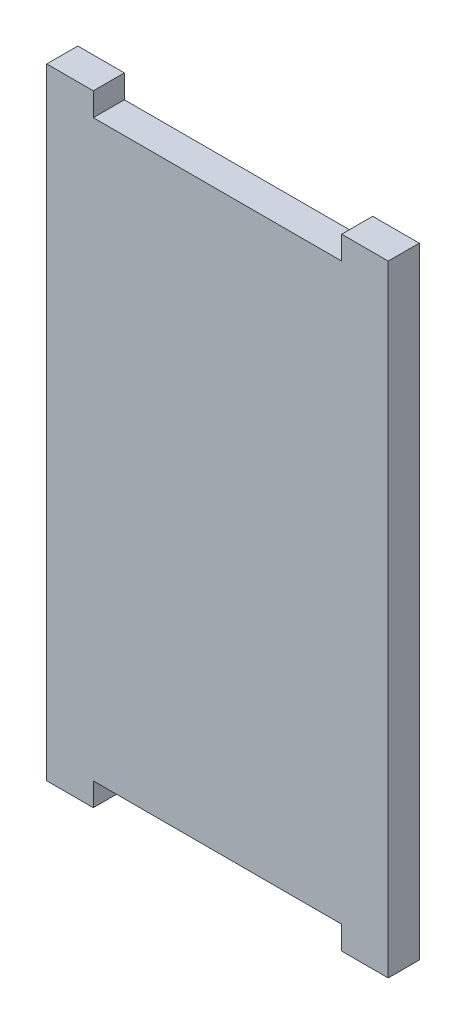
ISO-10303-21;
HEADER;
FILE_DESCRIPTION(('STEP AP214'),'2;1');
FILE_NAME('part.step','',(''),(''),'','','');
FILE_SCHEMA(('AUTOMOTIVE_DESIGN { 1 0 10303 214 1 1 1 1 }'));
ENDSEC;
DATA;
#1=APPLICATION_CONTEXT('core data for automotive mechanical design processes');
#2=APPLICATION_PROTOCOL_DEFINITION('international standard','automotive_design',2000,#1);
#3=PRODUCT_CONTEXT('',#1,'mechanical');
#4=PRODUCT('Part','Part','',(#3));
#5=PRODUCT_RELATED_PRODUCT_CATEGORY('part','',(#4));
#6=PRODUCT_DEFINITION_FORMATION('','',#4);
#7=PRODUCT_DEFINITION_CONTEXT('part definition',#1,'design');
#8=PRODUCT_DEFINITION('design','',#6,#7);
#9=PRODUCT_DEFINITION_SHAPE('','',#8);
#10=(LENGTH_UNIT() NAMED_UNIT(*) SI_UNIT(.MILLI.,.METRE.));
#11=(NAMED_UNIT(*) PLANE_ANGLE_UNIT() SI_UNIT($,.RADIAN.));
#12=(NAMED_UNIT(*) SI_UNIT($,.STERADIAN.) SOLID_ANGLE_UNIT());
#13=UNCERTAINTY_MEASURE_WITH_UNIT(LENGTH_MEASURE(1.E-05),#10,'distance_accuracy_value','');
#14=(GEOMETRIC_REPRESENTATION_CONTEXT(3) GLOBAL_UNCERTAINTY_ASSIGNED_CONTEXT((#13)) GLOBAL_UNIT_ASSIGNED_CONTEXT((#10,
#11,#12)) REPRESENTATION_CONTEXT('',''));
#15=CARTESIAN_POINT('',(0.,0.,0.));
#16=DIRECTION('',(0.,0.,1.));
#17=DIRECTION('',(1.,0.,0.));
#18=AXIS2_PLACEMENT_3D('',#15,#16,#17);
#19=CARTESIAN_POINT('',(0.,0.,4.));
#20=DIRECTION('',(0.,1.,0.));
#21=DIRECTION('',(0.,0.,1.));
#22=AXIS2_PLACEMENT_3D('',#19,#20,#21);
#23=PLANE('',#22);
#24=DIRECTION('',(1.,0.,0.));
#25=VECTOR('',#24,1.);
#26=CARTESIAN_POINT('',(0.,0.,0.));
#27=LINE('',#26,#25);
#28=CARTESIAN_POINT('',(0.,0.,0.));
#29=VERTEX_POINT('',#28);
#30=CARTESIAN_POINT('',(6.,0.,0.));
#31=VERTEX_POINT('',#30);
#32=EDGE_CURVE('E198',#29,#31,#27,.T.);
#33=ORIENTED_EDGE('',*,*,#32,.T.);
#34=DIRECTION('',(0.,0.,1.));
#35=VECTOR('',#34,1.);
#36=CARTESIAN_POINT('',(6.,0.,0.));
#37=LINE('',#36,#35);
#38=CARTESIAN_POINT('',(6.,0.,4.));
#39=VERTEX_POINT('',#38);
#40=EDGE_CURVE('E149',#31,#39,#37,.T.);
#41=ORIENTED_EDGE('',*,*,#40,.T.);
#42=DIRECTION('',(1.,0.,0.));
#43=VECTOR('',#42,1.);
#44=CARTESIAN_POINT('',(0.,0.,4.));
#45=LINE('',#44,#43);
#46=CARTESIAN_POINT('',(0.,0.,4.));
#47=VERTEX_POINT('',#46);
#48=EDGE_CURVE('E185',#47,#39,#45,.T.);
#49=ORIENTED_EDGE('',*,*,#48,.F.);
#50=DIRECTION('',(0.,0.,-1.));
#51=VECTOR('',#50,1.);
#52=CARTESIAN_POINT('',(0.,0.,4.));
#53=LINE('',#52,#51);
#54=EDGE_CURVE('E11',#47,#29,#53,.T.);
#55=ORIENTED_EDGE('',*,*,#54,.T.);
#56=EDGE_LOOP('',(#33,#41,#49,#55));
#57=FACE_BOUND('',#56,.T.);
#58=ADVANCED_FACE('F33',(#57),#23,.F.);
#59=CARTESIAN_POINT('',(0.,80.,4.));
#60=DIRECTION('',(0.,-1.,0.));
#61=DIRECTION('',(0.,0.,-1.));
#62=AXIS2_PLACEMENT_3D('',#59,#60,#61);
#63=PLANE('',#62);
#64=DIRECTION('',(-1.,0.,0.));
#65=VECTOR('',#64,1.);
#66=CARTESIAN_POINT('',(0.,80.,4.));
#67=LINE('',#66,#65);
#68=CARTESIAN_POINT('',(5.99999999999999,80.,4.));
#69=VERTEX_POINT('',#68);
#70=CARTESIAN_POINT('',(0.,80.,4.));
#71=VERTEX_POINT('',#70);
#72=EDGE_CURVE('E190',#69,#71,#67,.T.);
#73=ORIENTED_EDGE('',*,*,#72,.F.);
#74=DIRECTION('',(0.,0.,1.));
#75=VECTOR('',#74,1.);
#76=CARTESIAN_POINT('',(5.99999999999999,80.,0.));
#77=LINE('',#76,#75);
#78=CARTESIAN_POINT('',(5.99999999999999,80.,0.));
#79=VERTEX_POINT('',#78);
#80=EDGE_CURVE('E154',#79,#69,#77,.T.);
#81=ORIENTED_EDGE('',*,*,#80,.F.);
#82=DIRECTION('',(-1.,0.,0.));
#83=VECTOR('',#82,1.);
#84=CARTESIAN_POINT('',(0.,80.,0.));
#85=LINE('',#84,#83);
#86=CARTESIAN_POINT('',(0.,80.,0.));
#87=VERTEX_POINT('',#86);
#88=EDGE_CURVE('E203',#79,#87,#85,.T.);
#89=ORIENTED_EDGE('',*,*,#88,.T.);
#90=DIRECTION('',(0.,0.,-1.));
#91=VECTOR('',#90,1.);
#92=CARTESIAN_POINT('',(0.,80.,4.));
#93=LINE('',#92,#91);
#94=EDGE_CURVE('E194',#71,#87,#93,.T.);
#95=ORIENTED_EDGE('',*,*,#94,.F.);
#96=EDGE_LOOP('',(#73,#81,#89,#95));
#97=FACE_BOUND('',#96,.T.);
#98=ADVANCED_FACE('F241',(#97),#63,.F.);
#99=CARTESIAN_POINT('',(0.,0.,4.));
#100=DIRECTION('',(1.,0.,0.));
#101=DIRECTION('',(0.,0.,-1.));
#102=AXIS2_PLACEMENT_3D('',#99,#100,#101);
#103=PLANE('',#102);
#104=DIRECTION('',(0.,-1.,0.));
#105=VECTOR('',#104,1.);
#106=CARTESIAN_POINT('',(0.,0.,0.));
#107=LINE('',#106,#105);
#108=EDGE_CURVE('E153',#87,#29,#107,.T.);
#109=ORIENTED_EDGE('',*,*,#108,.T.);
#110=ORIENTED_EDGE('',*,*,#54,.F.);
#111=DIRECTION('',(0.,-1.,0.));
#112=VECTOR('',#111,1.);
#113=CARTESIAN_POINT('',(0.,0.,4.));
#114=LINE('',#113,#112);
#115=EDGE_CURVE('E180',#71,#47,#114,.T.);
#116=ORIENTED_EDGE('',*,*,#115,.F.);
#117=ORIENTED_EDGE('',*,*,#94,.T.);
#118=EDGE_LOOP('',(#109,#110,#116,#117));
#119=FACE_BOUND('',#118,.T.);
#120=ADVANCED_FACE('F35',(#119),#103,.F.);
#121=CARTESIAN_POINT('',(38.,0.,4.));
#122=VERTEX_POINT('',#121);
#123=CARTESIAN_POINT('',(44.,0.,4.));
#124=VERTEX_POINT('',#123);
#125=EDGE_CURVE('E183',#122,#124,#45,.T.);
#126=ORIENTED_EDGE('',*,*,#125,.F.);
#127=DIRECTION('',(0.,0.,1.));
#128=VECTOR('',#127,1.);
#129=CARTESIAN_POINT('',(38.,0.,0.));
#130=LINE('',#129,#128);
#131=CARTESIAN_POINT('',(38.,0.,0.));
#132=VERTEX_POINT('',#131);
#133=EDGE_CURVE('E165',#132,#122,#130,.T.);
#134=ORIENTED_EDGE('',*,*,#133,.F.);
#135=CARTESIAN_POINT('',(44.,0.,0.));
#136=VERTEX_POINT('',#135);
#137=EDGE_CURVE('E197',#132,#136,#27,.T.);
#138=ORIENTED_EDGE('',*,*,#137,.T.);
#139=DIRECTION('',(0.,0.,-1.));
#140=VECTOR('',#139,1.);
#141=CARTESIAN_POINT('',(44.,0.,4.));
#142=LINE('',#141,#140);
#143=EDGE_CURVE('E41',#124,#136,#142,.T.);
#144=ORIENTED_EDGE('',*,*,#143,.F.);
#145=EDGE_LOOP('',(#126,#134,#138,#144));
#146=FACE_BOUND('',#145,.T.);
#147=ADVANCED_FACE('F227',(#146),#23,.F.);
#148=CARTESIAN_POINT('',(44.,0.,4.));
#149=DIRECTION('',(-1.,0.,0.));
#150=DIRECTION('',(0.,0.,1.));
#151=AXIS2_PLACEMENT_3D('',#148,#149,#150);
#152=PLANE('',#151);
#153=DIRECTION('',(0.,1.,0.));
#154=VECTOR('',#153,1.);
#155=CARTESIAN_POINT('',(44.,0.,0.));
#156=LINE('',#155,#154);
#157=CARTESIAN_POINT('',(44.,80.,0.));
#158=VERTEX_POINT('',#157);
#159=EDGE_CURVE('E201',#136,#158,#156,.T.);
#160=ORIENTED_EDGE('',*,*,#159,.T.);
#161=DIRECTION('',(0.,0.,-1.));
#162=VECTOR('',#161,1.);
#163=CARTESIAN_POINT('',(44.,80.,4.));
#164=LINE('',#163,#162);
#165=CARTESIAN_POINT('',(44.,80.,4.));
#166=VERTEX_POINT('',#165);
#167=EDGE_CURVE('E207',#166,#158,#164,.T.);
#168=ORIENTED_EDGE('',*,*,#167,.F.);
#169=DIRECTION('',(0.,1.,0.));
#170=VECTOR('',#169,1.);
#171=CARTESIAN_POINT('',(44.,0.,4.));
#172=LINE('',#171,#170);
#173=EDGE_CURVE('E188',#124,#166,#172,.T.);
#174=ORIENTED_EDGE('',*,*,#173,.F.);
#175=ORIENTED_EDGE('',*,*,#143,.T.);
#176=EDGE_LOOP('',(#160,#168,#174,#175));
#177=FACE_BOUND('',#176,.T.);
#178=ADVANCED_FACE('F214',(#177),#152,.F.);
#179=CARTESIAN_POINT('',(38.,80.,0.));
#180=VERTEX_POINT('',#179);
#181=EDGE_CURVE('E184',#158,#180,#85,.T.);
#182=ORIENTED_EDGE('',*,*,#181,.T.);
#183=DIRECTION('',(0.,0.,1.));
#184=VECTOR('',#183,1.);
#185=CARTESIAN_POINT('',(38.,80.,0.));
#186=LINE('',#185,#184);
#187=CARTESIAN_POINT('',(38.,80.,4.));
#188=VERTEX_POINT('',#187);
#189=EDGE_CURVE('E56',#180,#188,#186,.T.);
#190=ORIENTED_EDGE('',*,*,#189,.T.);
#191=EDGE_CURVE('E191',#166,#188,#67,.T.);
#192=ORIENTED_EDGE('',*,*,#191,.F.);
#193=ORIENTED_EDGE('',*,*,#167,.T.);
#194=EDGE_LOOP('',(#182,#190,#192,#193));
#195=FACE_BOUND('',#194,.T.);
#196=ADVANCED_FACE('F220',(#195),#63,.F.);
#197=CARTESIAN_POINT('',(0.,0.,4.));
#198=DIRECTION('',(0.,0.,-1.));
#199=DIRECTION('',(-1.,0.,0.));
#200=AXIS2_PLACEMENT_3D('',#197,#198,#199);
#201=PLANE('',#200);
#202=DIRECTION('',(1.,0.,0.));
#203=VECTOR('',#202,1.);
#204=CARTESIAN_POINT('',(5.99999999999999,77.,4.));
#205=LINE('',#204,#203);
#206=CARTESIAN_POINT('',(5.99999999999999,77.,4.));
#207=VERTEX_POINT('',#206);
#208=CARTESIAN_POINT('',(38.,77.,4.));
#209=VERTEX_POINT('',#208);
#210=EDGE_CURVE('E129',#207,#209,#205,.T.);
#211=ORIENTED_EDGE('',*,*,#210,.F.);
#212=DIRECTION('',(0.,-1.,0.));
#213=VECTOR('',#212,1.);
#214=CARTESIAN_POINT('',(5.99999999999999,80.,4.));
#215=LINE('',#214,#213);
#216=EDGE_CURVE('E141',#69,#207,#215,.T.);
#217=ORIENTED_EDGE('',*,*,#216,.F.);
#218=ORIENTED_EDGE('',*,*,#72,.T.);
#219=ORIENTED_EDGE('',*,*,#115,.T.);
#220=ORIENTED_EDGE('',*,*,#48,.T.);
#221=DIRECTION('',(0.,-1.,0.));
#222=VECTOR('',#221,1.);
#223=CARTESIAN_POINT('',(6.,0.,4.));
#224=LINE('',#223,#222);
#225=CARTESIAN_POINT('',(6.,3.,4.));
#226=VERTEX_POINT('',#225);
#227=EDGE_CURVE('E160',#226,#39,#224,.T.);
#228=ORIENTED_EDGE('',*,*,#227,.F.);
#229=DIRECTION('',(-1.,0.,0.));
#230=VECTOR('',#229,1.);
#231=CARTESIAN_POINT('',(6.,3.,4.));
#232=LINE('',#231,#230);
#233=CARTESIAN_POINT('',(38.,3.,4.));
#234=VERTEX_POINT('',#233);
#235=EDGE_CURVE('E169',#234,#226,#232,.T.);
#236=ORIENTED_EDGE('',*,*,#235,.F.);
#237=DIRECTION('',(0.,1.,0.));
#238=VECTOR('',#237,1.);
#239=CARTESIAN_POINT('',(38.,3.,4.));
#240=LINE('',#239,#238);
#241=EDGE_CURVE('E166',#122,#234,#240,.T.);
#242=ORIENTED_EDGE('',*,*,#241,.F.);
#243=ORIENTED_EDGE('',*,*,#125,.T.);
#244=ORIENTED_EDGE('',*,*,#173,.T.);
#245=ORIENTED_EDGE('',*,*,#191,.T.);
#246=DIRECTION('',(0.,1.,0.));
#247=VECTOR('',#246,1.);
#248=CARTESIAN_POINT('',(38.,77.,4.));
#249=LINE('',#248,#247);
#250=EDGE_CURVE('E144',#209,#188,#249,.T.);
#251=ORIENTED_EDGE('',*,*,#250,.F.);
#252=EDGE_LOOP('',(#211,#217,#218,#219,#220,#228,#236,#242,#243,#244,#245,#251));
#253=FACE_BOUND('',#252,.T.);
#254=ADVANCED_FACE('F223',(#253),#201,.F.);
#255=CARTESIAN_POINT('',(0.,0.,0.));
#256=DIRECTION('',(0.,0.,-1.));
#257=DIRECTION('',(-1.,0.,0.));
#258=AXIS2_PLACEMENT_3D('',#255,#256,#257);
#259=PLANE('',#258);
#260=DIRECTION('',(0.,-1.,0.));
#261=VECTOR('',#260,1.);
#262=CARTESIAN_POINT('',(5.99999999999999,80.,0.));
#263=LINE('',#262,#261);
#264=CARTESIAN_POINT('',(5.99999999999999,77.,0.));
#265=VERTEX_POINT('',#264);
#266=EDGE_CURVE('E131',#79,#265,#263,.T.);
#267=ORIENTED_EDGE('',*,*,#266,.T.);
#268=DIRECTION('',(1.,0.,0.));
#269=VECTOR('',#268,1.);
#270=CARTESIAN_POINT('',(5.99999999999999,77.,0.));
#271=LINE('',#270,#269);
#272=CARTESIAN_POINT('',(38.,77.,0.));
#273=VERTEX_POINT('',#272);
#274=EDGE_CURVE('E126',#265,#273,#271,.T.);
#275=ORIENTED_EDGE('',*,*,#274,.T.);
#276=DIRECTION('',(0.,1.,0.));
#277=VECTOR('',#276,1.);
#278=CARTESIAN_POINT('',(38.,77.,0.));
#279=LINE('',#278,#277);
#280=EDGE_CURVE('E133',#273,#180,#279,.T.);
#281=ORIENTED_EDGE('',*,*,#280,.T.);
#282=ORIENTED_EDGE('',*,*,#181,.F.);
#283=ORIENTED_EDGE('',*,*,#159,.F.);
#284=ORIENTED_EDGE('',*,*,#137,.F.);
#285=DIRECTION('',(0.,1.,0.));
#286=VECTOR('',#285,1.);
#287=CARTESIAN_POINT('',(38.,3.,0.));
#288=LINE('',#287,#286);
#289=CARTESIAN_POINT('',(38.,3.,0.));
#290=VERTEX_POINT('',#289);
#291=EDGE_CURVE('E157',#132,#290,#288,.T.);
#292=ORIENTED_EDGE('',*,*,#291,.T.);
#293=DIRECTION('',(-1.,0.,0.));
#294=VECTOR('',#293,1.);
#295=CARTESIAN_POINT('',(6.,3.,0.));
#296=LINE('',#295,#294);
#297=CARTESIAN_POINT('',(6.,3.,0.));
#298=VERTEX_POINT('',#297);
#299=EDGE_CURVE('E48',#290,#298,#296,.T.);
#300=ORIENTED_EDGE('',*,*,#299,.T.);
#301=DIRECTION('',(0.,-1.,0.));
#302=VECTOR('',#301,1.);
#303=CARTESIAN_POINT('',(6.,0.,0.));
#304=LINE('',#303,#302);
#305=EDGE_CURVE('E162',#298,#31,#304,.T.);
#306=ORIENTED_EDGE('',*,*,#305,.T.);
#307=ORIENTED_EDGE('',*,*,#32,.F.);
#308=ORIENTED_EDGE('',*,*,#108,.F.);
#309=ORIENTED_EDGE('',*,*,#88,.F.);
#310=EDGE_LOOP('',(#267,#275,#281,#282,#283,#284,#292,#300,#306,#307,#308,#309));
#311=FACE_BOUND('',#310,.T.);
#312=ADVANCED_FACE('F139',(#311),#259,.T.);
#313=CARTESIAN_POINT('',(6.,0.,0.));
#314=DIRECTION('',(-1.,0.,0.));
#315=DIRECTION('',(0.,0.,1.));
#316=AXIS2_PLACEMENT_3D('',#313,#314,#315);
#317=PLANE('',#316);
#318=ORIENTED_EDGE('',*,*,#227,.T.);
#319=ORIENTED_EDGE('',*,*,#40,.F.);
#320=ORIENTED_EDGE('',*,*,#305,.F.);
#321=DIRECTION('',(0.,0.,1.));
#322=VECTOR('',#321,1.);
#323=CARTESIAN_POINT('',(6.,3.,0.));
#324=LINE('',#323,#322);
#325=EDGE_CURVE('E175',#298,#226,#324,.T.);
#326=ORIENTED_EDGE('',*,*,#325,.T.);
#327=EDGE_LOOP('',(#318,#319,#320,#326));
#328=FACE_BOUND('',#327,.T.);
#329=ADVANCED_FACE('F246',(#328),#317,.F.);
#330=CARTESIAN_POINT('',(6.,3.,0.));
#331=DIRECTION('',(0.,1.,0.));
#332=DIRECTION('',(0.,0.,1.));
#333=AXIS2_PLACEMENT_3D('',#330,#331,#332);
#334=PLANE('',#333);
#335=ORIENTED_EDGE('',*,*,#235,.T.);
#336=ORIENTED_EDGE('',*,*,#325,.F.);
#337=ORIENTED_EDGE('',*,*,#299,.F.);
#338=DIRECTION('',(0.,0.,1.));
#339=VECTOR('',#338,1.);
#340=CARTESIAN_POINT('',(38.,3.,0.));
#341=LINE('',#340,#339);
#342=EDGE_CURVE('E177',#290,#234,#341,.T.);
#343=ORIENTED_EDGE('',*,*,#342,.T.);
#344=EDGE_LOOP('',(#335,#336,#337,#343));
#345=FACE_BOUND('',#344,.T.);
#346=ADVANCED_FACE('F247',(#345),#334,.F.);
#347=CARTESIAN_POINT('',(38.,3.,0.));
#348=DIRECTION('',(1.,0.,0.));
#349=DIRECTION('',(0.,0.,-1.));
#350=AXIS2_PLACEMENT_3D('',#347,#348,#349);
#351=PLANE('',#350);
#352=ORIENTED_EDGE('',*,*,#241,.T.);
#353=ORIENTED_EDGE('',*,*,#342,.F.);
#354=ORIENTED_EDGE('',*,*,#291,.F.);
#355=ORIENTED_EDGE('',*,*,#133,.T.);
#356=EDGE_LOOP('',(#352,#353,#354,#355));
#357=FACE_BOUND('',#356,.T.);
#358=ADVANCED_FACE('F229',(#357),#351,.F.);
#359=CARTESIAN_POINT('',(5.99999999999999,77.,0.));
#360=DIRECTION('',(0.,-1.,0.));
#361=DIRECTION('',(0.,0.,-1.));
#362=AXIS2_PLACEMENT_3D('',#359,#360,#361);
#363=PLANE('',#362);
#364=ORIENTED_EDGE('',*,*,#210,.T.);
#365=DIRECTION('',(0.,0.,1.));
#366=VECTOR('',#365,1.);
#367=CARTESIAN_POINT('',(38.,77.,0.));
#368=LINE('',#367,#366);
#369=EDGE_CURVE('E123',#273,#209,#368,.T.);
#370=ORIENTED_EDGE('',*,*,#369,.F.);
#371=ORIENTED_EDGE('',*,*,#274,.F.);
#372=DIRECTION('',(0.,0.,1.));
#373=VECTOR('',#372,1.);
#374=CARTESIAN_POINT('',(5.99999999999999,77.,0.));
#375=LINE('',#374,#373);
#376=EDGE_CURVE('E151',#265,#207,#375,.T.);
#377=ORIENTED_EDGE('',*,*,#376,.T.);
#378=EDGE_LOOP('',(#364,#370,#371,#377));
#379=FACE_BOUND('',#378,.T.);
#380=ADVANCED_FACE('F124',(#379),#363,.F.);
#381=CARTESIAN_POINT('',(5.99999999999999,80.,0.));
#382=DIRECTION('',(-1.,0.,0.));
#383=DIRECTION('',(0.,0.,1.));
#384=AXIS2_PLACEMENT_3D('',#381,#382,#383);
#385=PLANE('',#384);
#386=ORIENTED_EDGE('',*,*,#216,.T.);
#387=ORIENTED_EDGE('',*,*,#376,.F.);
#388=ORIENTED_EDGE('',*,*,#266,.F.);
#389=ORIENTED_EDGE('',*,*,#80,.T.);
#390=EDGE_LOOP('',(#386,#387,#388,#389));
#391=FACE_BOUND('',#390,.T.);
#392=ADVANCED_FACE('F244',(#391),#385,.F.);
#393=CARTESIAN_POINT('',(38.,77.,0.));
#394=DIRECTION('',(1.,0.,0.));
#395=DIRECTION('',(0.,0.,-1.));
#396=AXIS2_PLACEMENT_3D('',#393,#394,#395);
#397=PLANE('',#396);
#398=ORIENTED_EDGE('',*,*,#250,.T.);
#399=ORIENTED_EDGE('',*,*,#189,.F.);
#400=ORIENTED_EDGE('',*,*,#280,.F.);
#401=ORIENTED_EDGE('',*,*,#369,.T.);
#402=EDGE_LOOP('',(#398,#399,#400,#401));
#403=FACE_BOUND('',#402,.T.);
#404=ADVANCED_FACE('F134',(#403),#397,.F.);
#405=CLOSED_SHELL('',(#58,#98,#120,#147,#178,#196,#254,#312,#329,#346,#358,#380,#392,#404));
#406=MANIFOLD_SOLID_BREP('B2',#405);
#407=ADVANCED_BREP_SHAPE_REPRESENTATION('',(#18,#406),#14);
#408=SHAPE_DEFINITION_REPRESENTATION(#9,#407);
ENDSEC;
END-ISO-10303-21;
